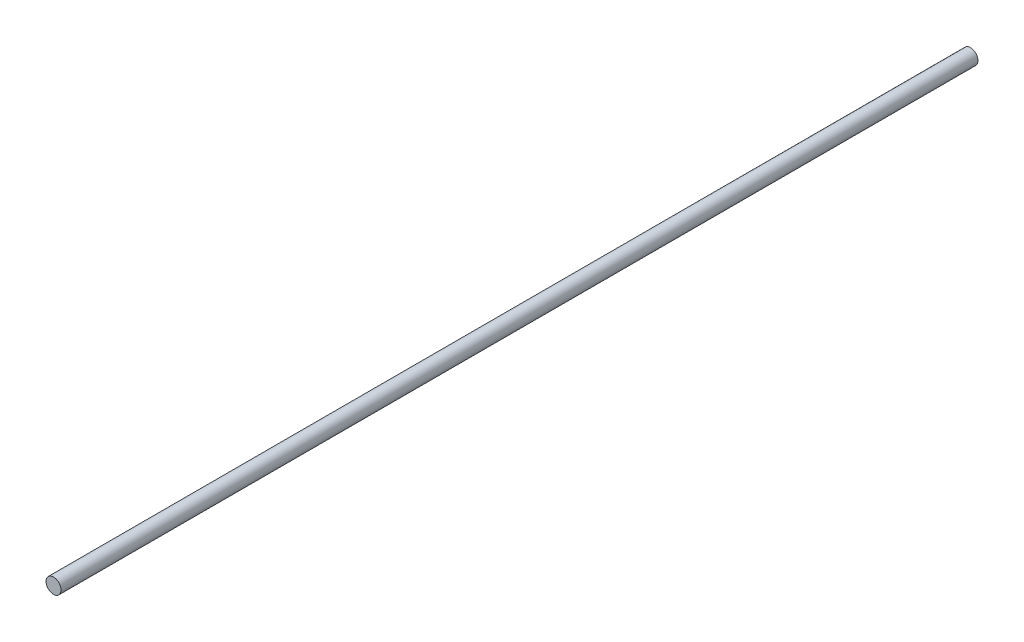
ISO-10303-21;
HEADER;
FILE_DESCRIPTION(('STEP AP214'),'2;1');
FILE_NAME('part.step','',(''),(''),'','','');
FILE_SCHEMA(('AUTOMOTIVE_DESIGN { 1 0 10303 214 1 1 1 1 }'));
ENDSEC;
DATA;
#1=APPLICATION_CONTEXT('core data for automotive mechanical design processes');
#2=APPLICATION_PROTOCOL_DEFINITION('international standard','automotive_design',2000,#1);
#3=PRODUCT_CONTEXT('',#1,'mechanical');
#4=PRODUCT('Part','Part','',(#3));
#5=PRODUCT_RELATED_PRODUCT_CATEGORY('part','',(#4));
#6=PRODUCT_DEFINITION_FORMATION('','',#4);
#7=PRODUCT_DEFINITION_CONTEXT('part definition',#1,'design');
#8=PRODUCT_DEFINITION('design','',#6,#7);
#9=PRODUCT_DEFINITION_SHAPE('','',#8);
#10=(LENGTH_UNIT() NAMED_UNIT(*) SI_UNIT(.MILLI.,.METRE.));
#11=(NAMED_UNIT(*) PLANE_ANGLE_UNIT() SI_UNIT($,.RADIAN.));
#12=(NAMED_UNIT(*) SI_UNIT($,.STERADIAN.) SOLID_ANGLE_UNIT());
#13=UNCERTAINTY_MEASURE_WITH_UNIT(LENGTH_MEASURE(1.E-05),#10,'distance_accuracy_value','');
#14=(GEOMETRIC_REPRESENTATION_CONTEXT(3) GLOBAL_UNCERTAINTY_ASSIGNED_CONTEXT((#13)) GLOBAL_UNIT_ASSIGNED_CONTEXT((#10,
#11,#12)) REPRESENTATION_CONTEXT('',''));
#15=CARTESIAN_POINT('',(0.,0.,0.));
#16=DIRECTION('',(0.,0.,1.));
#17=DIRECTION('',(1.,0.,0.));
#18=AXIS2_PLACEMENT_3D('',#15,#16,#17);
#19=CARTESIAN_POINT('',(0.,0.,488.));
#20=DIRECTION('',(0.,0.,-1.));
#21=DIRECTION('',(-1.,0.,0.));
#22=AXIS2_PLACEMENT_3D('',#19,#20,#21);
#23=CYLINDRICAL_SURFACE('',#22,4.);
#24=CARTESIAN_POINT('',(0.,0.,488.));
#25=DIRECTION('',(0.,0.,1.));
#26=DIRECTION('',(1.,0.,0.));
#27=AXIS2_PLACEMENT_3D('',#24,#25,#26);
#28=CIRCLE('',#27,4.);
#29=CARTESIAN_POINT('',(4.,0.,488.));
#30=VERTEX_POINT('',#29);
#31=EDGE_CURVE('E10',#30,#30,#28,.T.);
#32=ORIENTED_EDGE('',*,*,#31,.F.);
#33=EDGE_LOOP('',(#32));
#34=FACE_BOUND('',#33,.T.);
#35=CARTESIAN_POINT('',(0.,0.,0.));
#36=DIRECTION('',(0.,0.,1.));
#37=DIRECTION('',(1.,0.,0.));
#38=AXIS2_PLACEMENT_3D('',#35,#36,#37);
#39=CIRCLE('',#38,4.);
#40=CARTESIAN_POINT('',(4.,0.,0.));
#41=VERTEX_POINT('',#40);
#42=EDGE_CURVE('E34',#41,#41,#39,.T.);
#43=ORIENTED_EDGE('',*,*,#42,.T.);
#44=EDGE_LOOP('',(#43));
#45=FACE_BOUND('',#44,.T.);
#46=ADVANCED_FACE('F31',(#34,#45),#23,.T.);
#47=CARTESIAN_POINT('',(0.,0.,488.));
#48=DIRECTION('',(0.,0.,1.));
#49=DIRECTION('',(1.,0.,0.));
#50=AXIS2_PLACEMENT_3D('',#47,#48,#49);
#51=PLANE('',#50);
#52=ORIENTED_EDGE('',*,*,#31,.T.);
#53=EDGE_LOOP('',(#52));
#54=FACE_BOUND('',#53,.T.);
#55=ADVANCED_FACE('F46',(#54),#51,.T.);
#56=CARTESIAN_POINT('',(0.,0.,0.));
#57=DIRECTION('',(0.,0.,1.));
#58=DIRECTION('',(1.,0.,0.));
#59=AXIS2_PLACEMENT_3D('',#56,#57,#58);
#60=PLANE('',#59);
#61=ORIENTED_EDGE('',*,*,#42,.F.);
#62=EDGE_LOOP('',(#61));
#63=FACE_BOUND('',#62,.T.);
#64=ADVANCED_FACE('F44',(#63),#60,.F.);
#65=CLOSED_SHELL('',(#46,#55,#64));
#66=MANIFOLD_SOLID_BREP('B2',#65);
#67=ADVANCED_BREP_SHAPE_REPRESENTATION('',(#18,#66),#14);
#68=SHAPE_DEFINITION_REPRESENTATION(#9,#67);
ENDSEC;
END-ISO-10303-21;
